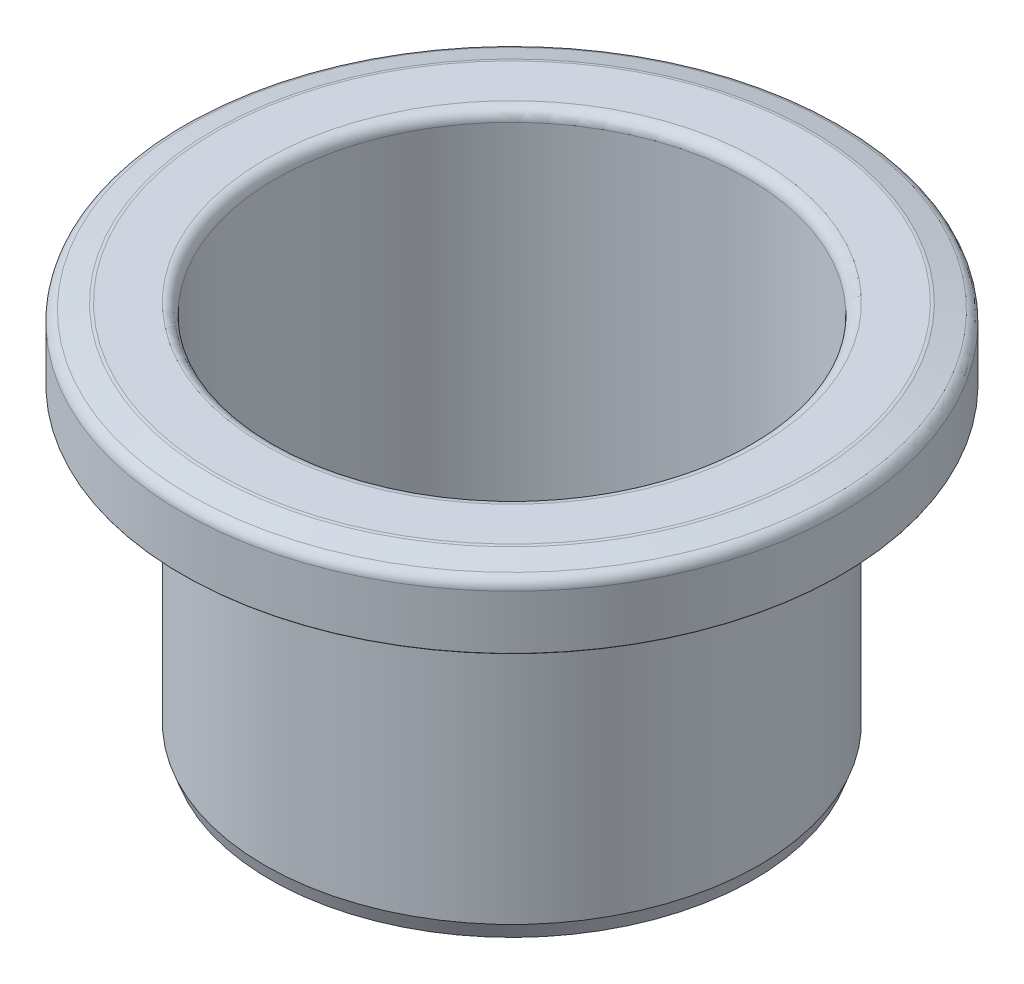
ISO-10303-21;
HEADER;
FILE_DESCRIPTION(('STEP AP214'),'2;1');
FILE_NAME('part.step','',(''),(''),'','','');
FILE_SCHEMA(('AUTOMOTIVE_DESIGN { 1 0 10303 214 1 1 1 1 }'));
ENDSEC;
DATA;
#1=APPLICATION_CONTEXT('core data for automotive mechanical design processes');
#2=APPLICATION_PROTOCOL_DEFINITION('international standard','automotive_design',2000,#1);
#3=PRODUCT_CONTEXT('',#1,'mechanical');
#4=PRODUCT('Part','Part','',(#3));
#5=PRODUCT_RELATED_PRODUCT_CATEGORY('part','',(#4));
#6=PRODUCT_DEFINITION_FORMATION('','',#4);
#7=PRODUCT_DEFINITION_CONTEXT('part definition',#1,'design');
#8=PRODUCT_DEFINITION('design','',#6,#7);
#9=PRODUCT_DEFINITION_SHAPE('','',#8);
#10=(LENGTH_UNIT() NAMED_UNIT(*) SI_UNIT(.MILLI.,.METRE.));
#11=(NAMED_UNIT(*) PLANE_ANGLE_UNIT() SI_UNIT($,.RADIAN.));
#12=(NAMED_UNIT(*) SI_UNIT($,.STERADIAN.) SOLID_ANGLE_UNIT());
#13=UNCERTAINTY_MEASURE_WITH_UNIT(LENGTH_MEASURE(1.E-05),#10,'distance_accuracy_value','');
#14=(GEOMETRIC_REPRESENTATION_CONTEXT(3) GLOBAL_UNCERTAINTY_ASSIGNED_CONTEXT((#13)) GLOBAL_UNIT_ASSIGNED_CONTEXT((#10,
#11,#12)) REPRESENTATION_CONTEXT('',''));
#15=CARTESIAN_POINT('',(0.,0.,0.));
#16=DIRECTION('',(0.,0.,1.));
#17=DIRECTION('',(1.,0.,0.));
#18=AXIS2_PLACEMENT_3D('',#15,#16,#17);
#19=CARTESIAN_POINT('',(0.,26.,0.));
#20=DIRECTION('',(0.,-1.,0.));
#21=DIRECTION('',(0.,0.,-1.));
#22=AXIS2_PLACEMENT_3D('',#19,#20,#21);
#23=PLANE('',#22);
#24=CARTESIAN_POINT('',(0.,26.,0.));
#25=DIRECTION('',(0.,-1.,0.));
#26=DIRECTION('',(0.,0.,-1.));
#27=AXIS2_PLACEMENT_3D('',#24,#25,#26);
#28=CIRCLE('',#27,29.05);
#29=CARTESIAN_POINT('',(0.,26.,-29.05));
#30=VERTEX_POINT('',#29);
#31=EDGE_CURVE('E97',#30,#30,#28,.F.);
#32=ORIENTED_EDGE('',*,*,#31,.T.);
#33=EDGE_LOOP('',(#32));
#34=FACE_BOUND('',#33,.T.);
#35=CARTESIAN_POINT('',(0.,26.,0.));
#36=DIRECTION('',(0.,-1.,0.));
#37=DIRECTION('',(0.,0.,-1.));
#38=AXIS2_PLACEMENT_3D('',#35,#36,#37);
#39=CIRCLE('',#38,29.95);
#40=CARTESIAN_POINT('',(0.,26.,-29.95));
#41=VERTEX_POINT('',#40);
#42=EDGE_CURVE('E100',#41,#41,#39,.T.);
#43=ORIENTED_EDGE('',*,*,#42,.T.);
#44=EDGE_LOOP('',(#43));
#45=FACE_BOUND('',#44,.T.);
#46=ADVANCED_FACE('F35',(#34,#45),#23,.T.);
#47=CARTESIAN_POINT('',(0.,-2.,0.));
#48=DIRECTION('',(0.,-1.,0.));
#49=DIRECTION('',(0.,0.,-1.));
#50=AXIS2_PLACEMENT_3D('',#47,#48,#49);
#51=PLANE('',#50);
#52=CARTESIAN_POINT('',(0.,-2.,0.));
#53=DIRECTION('',(0.,-1.,0.));
#54=DIRECTION('',(0.,0.,-1.));
#55=AXIS2_PLACEMENT_3D('',#52,#53,#54);
#56=CIRCLE('',#55,22.);
#57=CARTESIAN_POINT('',(0.,-2.,-22.));
#58=VERTEX_POINT('',#57);
#59=EDGE_CURVE('E10',#58,#58,#56,.T.);
#60=ORIENTED_EDGE('',*,*,#59,.T.);
#61=EDGE_LOOP('',(#60));
#62=FACE_BOUND('',#61,.T.);
#63=CARTESIAN_POINT('',(0.,-2.,0.));
#64=DIRECTION('',(0.,-1.,0.));
#65=DIRECTION('',(0.,0.,-1.));
#66=AXIS2_PLACEMENT_3D('',#63,#64,#65);
#67=CIRCLE('',#66,21.55);
#68=CARTESIAN_POINT('',(0.,-2.,-21.55));
#69=VERTEX_POINT('',#68);
#70=EDGE_CURVE('E88',#69,#69,#67,.F.);
#71=ORIENTED_EDGE('',*,*,#70,.T.);
#72=EDGE_LOOP('',(#71));
#73=FACE_BOUND('',#72,.T.);
#74=ADVANCED_FACE('F129',(#62,#73),#51,.T.);
#75=CARTESIAN_POINT('',(0.,-2.,0.));
#76=DIRECTION('',(0.,1.,0.));
#77=DIRECTION('',(0.,0.,1.));
#78=AXIS2_PLACEMENT_3D('',#75,#76,#77);
#79=CYLINDRICAL_SURFACE('',#78,21.5);
#80=CARTESIAN_POINT('',(0.,31.5,0.));
#81=DIRECTION('',(0.,1.,0.));
#82=DIRECTION('',(0.,0.,1.));
#83=AXIS2_PLACEMENT_3D('',#80,#81,#82);
#84=CIRCLE('',#83,21.5);
#85=CARTESIAN_POINT('',(0.,31.5,21.5));
#86=VERTEX_POINT('',#85);
#87=EDGE_CURVE('E82',#86,#86,#84,.T.);
#88=ORIENTED_EDGE('',*,*,#87,.T.);
#89=EDGE_LOOP('',(#88));
#90=FACE_BOUND('',#89,.T.);
#91=CARTESIAN_POINT('',(0.,-1.95,0.));
#92=DIRECTION('',(0.,-1.,0.));
#93=DIRECTION('',(0.,0.,-1.));
#94=AXIS2_PLACEMENT_3D('',#91,#92,#93);
#95=CIRCLE('',#94,21.5);
#96=CARTESIAN_POINT('',(0.,-1.95,-21.5));
#97=VERTEX_POINT('',#96);
#98=EDGE_CURVE('E85',#97,#97,#95,.T.);
#99=ORIENTED_EDGE('',*,*,#98,.T.);
#100=EDGE_LOOP('',(#99));
#101=FACE_BOUND('',#100,.T.);
#102=ADVANCED_FACE('F135',(#90,#101),#79,.F.);
#103=CARTESIAN_POINT('',(22.,32.5,0.));
#104=DIRECTION('',(0.,1.,0.));
#105=DIRECTION('',(0.,0.,1.));
#106=AXIS2_PLACEMENT_3D('',#103,#104,#105);
#107=PLANE('',#106);
#108=CARTESIAN_POINT('',(0.,32.5,0.));
#109=DIRECTION('',(0.,1.,0.));
#110=DIRECTION('',(0.,0.,1.));
#111=AXIS2_PLACEMENT_3D('',#108,#109,#110);
#112=CIRCLE('',#111,22.5);
#113=CARTESIAN_POINT('',(0.,32.5,22.5));
#114=VERTEX_POINT('',#113);
#115=EDGE_CURVE('E76',#114,#114,#112,.F.);
#116=ORIENTED_EDGE('',*,*,#115,.T.);
#117=EDGE_LOOP('',(#116));
#118=FACE_BOUND('',#117,.T.);
#119=CARTESIAN_POINT('',(0.,32.5,0.));
#120=DIRECTION('',(0.,1.,0.));
#121=DIRECTION('',(0.,0.,1.));
#122=AXIS2_PLACEMENT_3D('',#119,#120,#121);
#123=CIRCLE('',#122,26.9341737512063);
#124=CARTESIAN_POINT('',(0.,32.5,26.9341737512063));
#125=VERTEX_POINT('',#124);
#126=EDGE_CURVE('E79',#125,#125,#123,.T.);
#127=ORIENTED_EDGE('',*,*,#126,.T.);
#128=EDGE_LOOP('',(#127));
#129=FACE_BOUND('',#128,.T.);
#130=ADVANCED_FACE('F125',(#118,#129),#107,.T.);
#131=CARTESIAN_POINT('',(0.,32.4829629131445,0.));
#132=DIRECTION('',(0.,-1.,0.));
#133=DIRECTION('',(0.,0.,-1.));
#134=AXIS2_PLACEMENT_3D('',#131,#132,#133);
#135=CONICAL_SURFACE('',#134,27.1294095225513,1.30899693899575);
#136=CARTESIAN_POINT('',(0.,32.4659258262891,0.));
#137=DIRECTION('',(0.,1.,0.));
#138=DIRECTION('',(0.,0.,1.));
#139=AXIS2_PLACEMENT_3D('',#136,#137,#138);
#140=CIRCLE('',#139,27.1929927963088);
#141=CARTESIAN_POINT('',(0.,32.4659258262891,27.1929927963088));
#142=VERTEX_POINT('',#141);
#143=EDGE_CURVE('E70',#142,#142,#140,.F.);
#144=ORIENTED_EDGE('',*,*,#143,.T.);
#145=EDGE_LOOP('',(#144));
#146=FACE_BOUND('',#145,.T.);
#147=CARTESIAN_POINT('',(0.,31.9123893512218,0.));
#148=DIRECTION('',(0.,1.,0.));
#149=DIRECTION('',(0.,0.,1.));
#150=AXIS2_PLACEMENT_3D('',#147,#148,#149);
#151=CIRCLE('',#150,29.2588190451025);
#152=CARTESIAN_POINT('',(0.,31.9123893512218,29.2588190451025));
#153=VERTEX_POINT('',#152);
#154=EDGE_CURVE('E73',#153,#153,#151,.T.);
#155=ORIENTED_EDGE('',*,*,#154,.T.);
#156=EDGE_LOOP('',(#155));
#157=FACE_BOUND('',#156,.T.);
#158=ADVANCED_FACE('F116',(#146,#157),#135,.T.);
#159=CARTESIAN_POINT('',(0.,-2.,0.));
#160=DIRECTION('',(0.,1.,0.));
#161=DIRECTION('',(0.,0.,1.));
#162=AXIS2_PLACEMENT_3D('',#159,#160,#161);
#163=CYLINDRICAL_SURFACE('',#162,30.);
#164=CARTESIAN_POINT('',(0.,30.9464635249327,0.));
#165=DIRECTION('',(0.,-1.,0.));
#166=DIRECTION('',(0.,0.,-1.));
#167=AXIS2_PLACEMENT_3D('',#164,#165,#166);
#168=CIRCLE('',#167,30.);
#169=CARTESIAN_POINT('',(0.,30.9464635249327,-30.));
#170=VERTEX_POINT('',#169);
#171=EDGE_CURVE('E67',#170,#170,#168,.T.);
#172=ORIENTED_EDGE('',*,*,#171,.T.);
#173=EDGE_LOOP('',(#172));
#174=FACE_BOUND('',#173,.T.);
#175=CARTESIAN_POINT('',(0.,26.05,0.));
#176=DIRECTION('',(0.,-1.,0.));
#177=DIRECTION('',(0.,0.,-1.));
#178=AXIS2_PLACEMENT_3D('',#175,#176,#177);
#179=CIRCLE('',#178,30.);
#180=CARTESIAN_POINT('',(0.,26.05,-30.));
#181=VERTEX_POINT('',#180);
#182=EDGE_CURVE('E91',#181,#181,#179,.F.);
#183=ORIENTED_EDGE('',*,*,#182,.T.);
#184=EDGE_LOOP('',(#183));
#185=FACE_BOUND('',#184,.T.);
#186=ADVANCED_FACE('F113',(#174,#185),#163,.T.);
#187=CARTESIAN_POINT('',(0.,-2.,0.));
#188=DIRECTION('',(0.,1.,0.));
#189=DIRECTION('',(0.,0.,1.));
#190=AXIS2_PLACEMENT_3D('',#187,#188,#189);
#191=CYLINDRICAL_SURFACE('',#190,22.5);
#192=CARTESIAN_POINT('',(0.,-0.626261290272684,0.));
#193=DIRECTION('',(0.,-1.,0.));
#194=DIRECTION('',(0.,0.,-1.));
#195=AXIS2_PLACEMENT_3D('',#192,#193,#194);
#196=CIRCLE('',#195,22.5);
#197=CARTESIAN_POINT('',(0.,-0.626261290272684,-22.5));
#198=VERTEX_POINT('',#197);
#199=EDGE_CURVE('E42',#198,#198,#196,.F.);
#200=ORIENTED_EDGE('',*,*,#199,.T.);
#201=EDGE_LOOP('',(#200));
#202=FACE_BOUND('',#201,.T.);
#203=CARTESIAN_POINT('',(0.,30.5,0.));
#204=DIRECTION('',(0.,1.,0.));
#205=DIRECTION('',(0.,0.,1.));
#206=AXIS2_PLACEMENT_3D('',#203,#204,#205);
#207=CIRCLE('',#206,22.5);
#208=CARTESIAN_POINT('',(0.,30.5,22.5));
#209=VERTEX_POINT('',#208);
#210=EDGE_CURVE('E46',#209,#209,#207,.F.);
#211=ORIENTED_EDGE('',*,*,#210,.T.);
#212=EDGE_LOOP('',(#211));
#213=FACE_BOUND('',#212,.T.);
#214=ADVANCED_FACE('F115',(#202,#213),#191,.T.);
#215=CARTESIAN_POINT('',(22.,31.5,0.));
#216=DIRECTION('',(0.,1.,0.));
#217=DIRECTION('',(0.,0.,1.));
#218=AXIS2_PLACEMENT_3D('',#215,#216,#217);
#219=PLANE('',#218);
#220=CARTESIAN_POINT('',(0.,31.5,0.));
#221=DIRECTION('',(0.,1.,0.));
#222=DIRECTION('',(0.,0.,1.));
#223=AXIS2_PLACEMENT_3D('',#220,#221,#222);
#224=CIRCLE('',#223,26.8025212536189);
#225=CARTESIAN_POINT('',(0.,31.5,26.8025212536189));
#226=VERTEX_POINT('',#225);
#227=EDGE_CURVE('E55',#226,#226,#224,.F.);
#228=ORIENTED_EDGE('',*,*,#227,.T.);
#229=EDGE_LOOP('',(#228));
#230=FACE_BOUND('',#229,.T.);
#231=CARTESIAN_POINT('',(0.,31.5,0.));
#232=DIRECTION('',(0.,1.,0.));
#233=DIRECTION('',(0.,0.,1.));
#234=AXIS2_PLACEMENT_3D('',#231,#232,#233);
#235=CIRCLE('',#234,23.5);
#236=CARTESIAN_POINT('',(0.,31.5,23.5));
#237=VERTEX_POINT('',#236);
#238=EDGE_CURVE('E58',#237,#237,#235,.T.);
#239=ORIENTED_EDGE('',*,*,#238,.T.);
#240=EDGE_LOOP('',(#239));
#241=FACE_BOUND('',#240,.T.);
#242=ADVANCED_FACE('F123',(#230,#241),#219,.F.);
#243=CARTESIAN_POINT('',(0.,31.5170370868555,0.));
#244=DIRECTION('',(0.,-1.,0.));
#245=DIRECTION('',(0.,0.,-1.));
#246=AXIS2_PLACEMENT_3D('',#243,#244,#245);
#247=CONICAL_SURFACE('',#246,26.8705904774487,1.30899693899575);
#248=CARTESIAN_POINT('',(0.,31.4659258262891,0.));
#249=DIRECTION('',(0.,-1.,0.));
#250=DIRECTION('',(0.,0.,-1.));
#251=AXIS2_PLACEMENT_3D('',#248,#249,#250);
#252=CIRCLE('',#251,27.0613402987214);
#253=CARTESIAN_POINT('',(0.,31.4659258262891,-27.0613402987214));
#254=VERTEX_POINT('',#253);
#255=EDGE_CURVE('E61',#254,#254,#252,.F.);
#256=ORIENTED_EDGE('',*,*,#255,.T.);
#257=EDGE_LOOP('',(#256));
#258=FACE_BOUND('',#257,.T.);
#259=CARTESIAN_POINT('',(0.,31.1450623632428,0.));
#260=DIRECTION('',(0.,-1.,0.));
#261=DIRECTION('',(0.,0.,-1.));
#262=AXIS2_PLACEMENT_3D('',#259,#260,#261);
#263=CIRCLE('',#262,28.2588190451025);
#264=CARTESIAN_POINT('',(0.,31.1450623632428,-28.2588190451025));
#265=VERTEX_POINT('',#264);
#266=EDGE_CURVE('E64',#265,#265,#263,.T.);
#267=ORIENTED_EDGE('',*,*,#266,.T.);
#268=EDGE_LOOP('',(#267));
#269=FACE_BOUND('',#268,.T.);
#270=ADVANCED_FACE('F177',(#258,#269),#247,.F.);
#271=CARTESIAN_POINT('',(0.,-2.,0.));
#272=DIRECTION('',(0.,1.,0.));
#273=DIRECTION('',(0.,0.,1.));
#274=AXIS2_PLACEMENT_3D('',#271,#272,#273);
#275=CYLINDRICAL_SURFACE('',#274,29.);
#276=CARTESIAN_POINT('',(0.,30.1791365369537,0.));
#277=DIRECTION('',(0.,1.,0.));
#278=DIRECTION('',(0.,0.,1.));
#279=AXIS2_PLACEMENT_3D('',#276,#277,#278);
#280=CIRCLE('',#279,29.);
#281=CARTESIAN_POINT('',(0.,30.1791365369537,29.));
#282=VERTEX_POINT('',#281);
#283=EDGE_CURVE('E50',#282,#282,#280,.T.);
#284=ORIENTED_EDGE('',*,*,#283,.T.);
#285=EDGE_LOOP('',(#284));
#286=FACE_BOUND('',#285,.T.);
#287=CARTESIAN_POINT('',(0.,26.05,0.));
#288=DIRECTION('',(0.,-1.,0.));
#289=DIRECTION('',(0.,0.,-1.));
#290=AXIS2_PLACEMENT_3D('',#287,#288,#289);
#291=CIRCLE('',#290,29.);
#292=CARTESIAN_POINT('',(0.,26.05,-29.));
#293=VERTEX_POINT('',#292);
#294=EDGE_CURVE('E94',#293,#293,#291,.T.);
#295=ORIENTED_EDGE('',*,*,#294,.T.);
#296=EDGE_LOOP('',(#295));
#297=FACE_BOUND('',#296,.T.);
#298=ADVANCED_FACE('F140',(#286,#297),#275,.F.);
#299=CARTESIAN_POINT('',(0.,26.05,0.));
#300=DIRECTION('',(0.,-1.,0.));
#301=DIRECTION('',(0.,0.,-1.));
#302=AXIS2_PLACEMENT_3D('',#299,#300,#301);
#303=TOROIDAL_SURFACE('',#302,29.05,0.05);
#304=ORIENTED_EDGE('',*,*,#294,.F.);
#305=EDGE_LOOP('',(#304));
#306=FACE_BOUND('',#305,.T.);
#307=ORIENTED_EDGE('',*,*,#31,.F.);
#308=EDGE_LOOP('',(#307));
#309=FACE_BOUND('',#308,.T.);
#310=ADVANCED_FACE('F109',(#306,#309),#303,.T.);
#311=CARTESIAN_POINT('',(0.,26.05,0.));
#312=DIRECTION('',(0.,-1.,0.));
#313=DIRECTION('',(0.,0.,-1.));
#314=AXIS2_PLACEMENT_3D('',#311,#312,#313);
#315=TOROIDAL_SURFACE('',#314,29.95,0.05);
#316=ORIENTED_EDGE('',*,*,#42,.F.);
#317=EDGE_LOOP('',(#316));
#318=FACE_BOUND('',#317,.T.);
#319=ORIENTED_EDGE('',*,*,#182,.F.);
#320=EDGE_LOOP('',(#319));
#321=FACE_BOUND('',#320,.T.);
#322=ADVANCED_FACE('F105',(#318,#321),#315,.T.);
#323=CARTESIAN_POINT('',(0.,-1.95,0.));
#324=DIRECTION('',(0.,-1.,0.));
#325=DIRECTION('',(0.,0.,-1.));
#326=AXIS2_PLACEMENT_3D('',#323,#324,#325);
#327=TOROIDAL_SURFACE('',#326,21.55,0.05);
#328=ORIENTED_EDGE('',*,*,#98,.F.);
#329=EDGE_LOOP('',(#328));
#330=FACE_BOUND('',#329,.T.);
#331=ORIENTED_EDGE('',*,*,#70,.F.);
#332=EDGE_LOOP('',(#331));
#333=FACE_BOUND('',#332,.T.);
#334=ADVANCED_FACE('F108',(#330,#333),#327,.T.);
#335=CARTESIAN_POINT('',(0.,31.5,0.));
#336=DIRECTION('',(0.,1.,0.));
#337=DIRECTION('',(0.,0.,1.));
#338=AXIS2_PLACEMENT_3D('',#335,#336,#337);
#339=TOROIDAL_SURFACE('',#338,22.5,1.);
#340=ORIENTED_EDGE('',*,*,#115,.F.);
#341=EDGE_LOOP('',(#340));
#342=FACE_BOUND('',#341,.T.);
#343=ORIENTED_EDGE('',*,*,#87,.F.);
#344=EDGE_LOOP('',(#343));
#345=FACE_BOUND('',#344,.T.);
#346=ADVANCED_FACE('F145',(#342,#345),#339,.T.);
#347=CARTESIAN_POINT('',(0.,31.5,0.));
#348=DIRECTION('',(0.,1.,0.));
#349=DIRECTION('',(0.,0.,1.));
#350=AXIS2_PLACEMENT_3D('',#347,#348,#349);
#351=TOROIDAL_SURFACE('',#350,26.9341737512063,1.);
#352=ORIENTED_EDGE('',*,*,#143,.F.);
#353=EDGE_LOOP('',(#352));
#354=FACE_BOUND('',#353,.T.);
#355=ORIENTED_EDGE('',*,*,#126,.F.);
#356=EDGE_LOOP('',(#355));
#357=FACE_BOUND('',#356,.T.);
#358=ADVANCED_FACE('F149',(#354,#357),#351,.T.);
#359=CARTESIAN_POINT('',(0.,30.9464635249327,0.));
#360=DIRECTION('',(0.,-1.,0.));
#361=DIRECTION('',(0.,0.,-1.));
#362=AXIS2_PLACEMENT_3D('',#359,#360,#361);
#363=TOROIDAL_SURFACE('',#362,29.,1.);
#364=ORIENTED_EDGE('',*,*,#171,.F.);
#365=EDGE_LOOP('',(#364));
#366=FACE_BOUND('',#365,.T.);
#367=ORIENTED_EDGE('',*,*,#154,.F.);
#368=EDGE_LOOP('',(#367));
#369=FACE_BOUND('',#368,.T.);
#370=ADVANCED_FACE('F153',(#366,#369),#363,.T.);
#371=CARTESIAN_POINT('',(0.,30.5,0.));
#372=DIRECTION('',(0.,1.,0.));
#373=DIRECTION('',(0.,0.,1.));
#374=AXIS2_PLACEMENT_3D('',#371,#372,#373);
#375=TOROIDAL_SURFACE('',#374,26.8025212536189,1.);
#376=ORIENTED_EDGE('',*,*,#227,.F.);
#377=EDGE_LOOP('',(#376));
#378=FACE_BOUND('',#377,.T.);
#379=ORIENTED_EDGE('',*,*,#255,.F.);
#380=EDGE_LOOP('',(#379));
#381=FACE_BOUND('',#380,.T.);
#382=ADVANCED_FACE('F157',(#378,#381),#375,.F.);
#383=CARTESIAN_POINT('',(0.,30.1791365369537,0.));
#384=DIRECTION('',(0.,1.,0.));
#385=DIRECTION('',(0.,0.,1.));
#386=AXIS2_PLACEMENT_3D('',#383,#384,#385);
#387=TOROIDAL_SURFACE('',#386,28.,1.);
#388=ORIENTED_EDGE('',*,*,#266,.F.);
#389=EDGE_LOOP('',(#388));
#390=FACE_BOUND('',#389,.T.);
#391=ORIENTED_EDGE('',*,*,#283,.F.);
#392=EDGE_LOOP('',(#391));
#393=FACE_BOUND('',#392,.T.);
#394=ADVANCED_FACE('F161',(#390,#393),#387,.F.);
#395=CARTESIAN_POINT('',(0.,30.5,0.));
#396=DIRECTION('',(0.,1.,0.));
#397=DIRECTION('',(0.,0.,1.));
#398=AXIS2_PLACEMENT_3D('',#395,#396,#397);
#399=TOROIDAL_SURFACE('',#398,23.5,1.);
#400=ORIENTED_EDGE('',*,*,#210,.F.);
#401=EDGE_LOOP('',(#400));
#402=FACE_BOUND('',#401,.T.);
#403=ORIENTED_EDGE('',*,*,#238,.F.);
#404=EDGE_LOOP('',(#403));
#405=FACE_BOUND('',#404,.T.);
#406=ADVANCED_FACE('F164',(#402,#405),#399,.F.);
#407=CARTESIAN_POINT('',(0.,-0.626261290272684,0.));
#408=DIRECTION('',(0.,1.,0.));
#409=DIRECTION('',(0.,0.,1.));
#410=AXIS2_PLACEMENT_3D('',#407,#408,#409);
#411=CONICAL_SURFACE('',#410,22.5,0.349065850398871);
#412=ORIENTED_EDGE('',*,*,#59,.F.);
#413=EDGE_LOOP('',(#412));
#414=FACE_BOUND('',#413,.T.);
#415=ORIENTED_EDGE('',*,*,#199,.F.);
#416=EDGE_LOOP('',(#415));
#417=FACE_BOUND('',#416,.T.);
#418=ADVANCED_FACE('F37',(#414,#417),#411,.T.);
#419=CLOSED_SHELL('',(#46,#74,#102,#130,#158,#186,#214,#242,#270,#298,#310,#322,#334,#346,#358,
#370,#382,#394,#406,#418));
#420=MANIFOLD_SOLID_BREP('B2',#419);
#421=ADVANCED_BREP_SHAPE_REPRESENTATION('',(#18,#420),#14);
#422=SHAPE_DEFINITION_REPRESENTATION(#9,#421);
ENDSEC;
END-ISO-10303-21;
